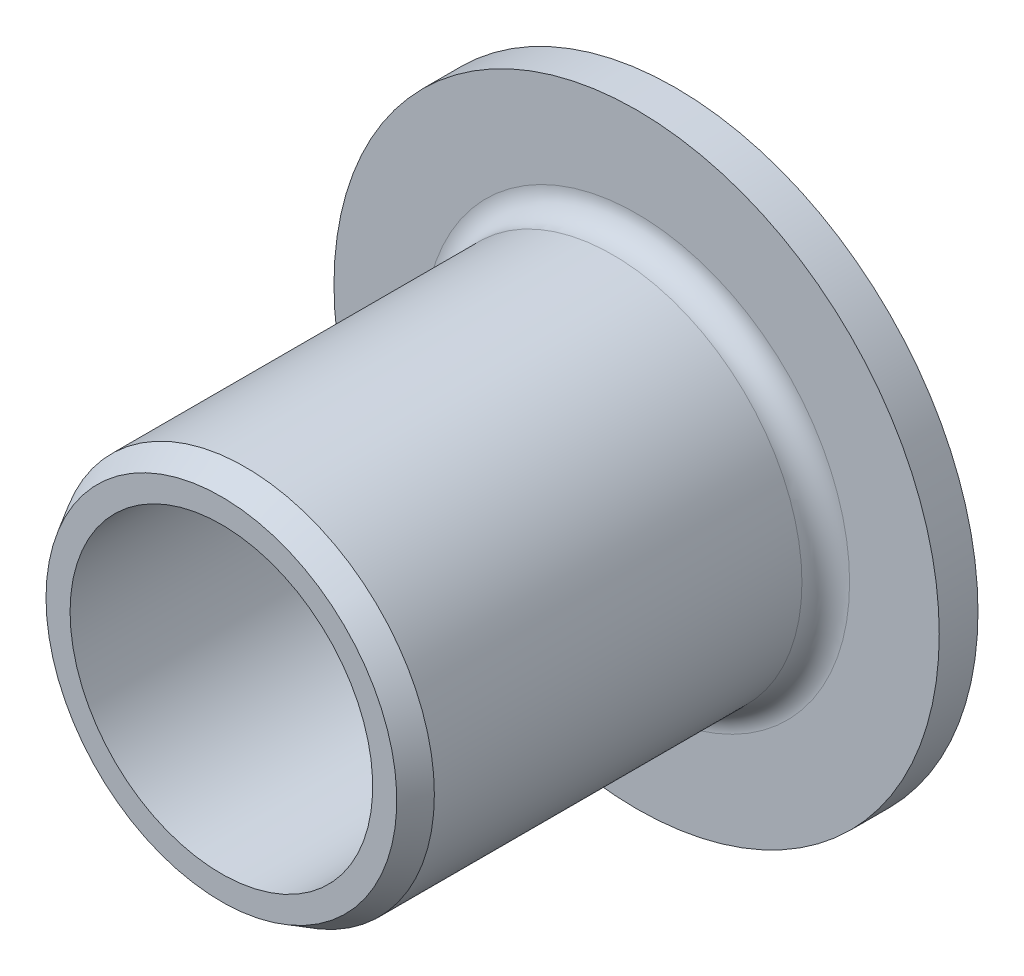
ISO-10303-21;
HEADER;
FILE_DESCRIPTION(('STEP AP214'),'2;1');
FILE_NAME('part.step','',(''),(''),'','','');
FILE_SCHEMA(('AUTOMOTIVE_DESIGN { 1 0 10303 214 1 1 1 1 }'));
ENDSEC;
DATA;
#1=APPLICATION_CONTEXT('core data for automotive mechanical design processes');
#2=APPLICATION_PROTOCOL_DEFINITION('international standard','automotive_design',2000,#1);
#3=PRODUCT_CONTEXT('',#1,'mechanical');
#4=PRODUCT('Part','Part','',(#3));
#5=PRODUCT_RELATED_PRODUCT_CATEGORY('part','',(#4));
#6=PRODUCT_DEFINITION_FORMATION('','',#4);
#7=PRODUCT_DEFINITION_CONTEXT('part definition',#1,'design');
#8=PRODUCT_DEFINITION('design','',#6,#7);
#9=PRODUCT_DEFINITION_SHAPE('','',#8);
#10=(LENGTH_UNIT() NAMED_UNIT(*) SI_UNIT(.MILLI.,.METRE.));
#11=(NAMED_UNIT(*) PLANE_ANGLE_UNIT() SI_UNIT($,.RADIAN.));
#12=(NAMED_UNIT(*) SI_UNIT($,.STERADIAN.) SOLID_ANGLE_UNIT());
#13=UNCERTAINTY_MEASURE_WITH_UNIT(LENGTH_MEASURE(1.E-05),#10,'distance_accuracy_value','');
#14=(GEOMETRIC_REPRESENTATION_CONTEXT(3) GLOBAL_UNCERTAINTY_ASSIGNED_CONTEXT((#13)) GLOBAL_UNIT_ASSIGNED_CONTEXT((#10,
#11,#12)) REPRESENTATION_CONTEXT('',''));
#15=CARTESIAN_POINT('',(0.,0.,0.));
#16=DIRECTION('',(0.,0.,1.));
#17=DIRECTION('',(1.,0.,0.));
#18=AXIS2_PLACEMENT_3D('',#15,#16,#17);
#19=CARTESIAN_POINT('',(4.7625,0.,0.));
#20=DIRECTION('',(0.,0.,-1.));
#21=DIRECTION('',(-1.,0.,0.));
#22=AXIS2_PLACEMENT_3D('',#19,#20,#21);
#23=PLANE('',#22);
#24=CARTESIAN_POINT('',(0.,0.,0.));
#25=DIRECTION('',(0.,0.,-1.));
#26=DIRECTION('',(-1.,0.,0.));
#27=AXIS2_PLACEMENT_3D('',#24,#25,#26);
#28=CIRCLE('',#27,3.175);
#29=CARTESIAN_POINT('',(-3.175,0.,0.));
#30=VERTEX_POINT('',#29);
#31=EDGE_CURVE('E123',#30,#30,#28,.F.);
#32=ORIENTED_EDGE('',*,*,#31,.T.);
#33=EDGE_LOOP('',(#32));
#34=FACE_BOUND('',#33,.T.);
#35=CARTESIAN_POINT('',(0.,0.,0.));
#36=DIRECTION('',(0.,0.,-1.));
#37=DIRECTION('',(-1.,0.,0.));
#38=AXIS2_PLACEMENT_3D('',#35,#36,#37);
#39=CIRCLE('',#38,6.35);
#40=CARTESIAN_POINT('',(-6.35,0.,0.));
#41=VERTEX_POINT('',#40);
#42=EDGE_CURVE('E127',#41,#41,#39,.F.);
#43=ORIENTED_EDGE('',*,*,#42,.F.);
#44=EDGE_LOOP('',(#43));
#45=FACE_BOUND('',#44,.T.);
#46=ADVANCED_FACE('F16',(#34,#45),#23,.T.);
#47=CARTESIAN_POINT('',(0.,0.,0.4064));
#48=DIRECTION('',(0.,0.,-1.));
#49=DIRECTION('',(-1.,0.,0.));
#50=AXIS2_PLACEMENT_3D('',#47,#48,#49);
#51=CYLINDRICAL_SURFACE('',#50,6.35);
#52=CARTESIAN_POINT('',(0.,0.,0.8128));
#53=DIRECTION('',(0.,0.,-1.));
#54=DIRECTION('',(-1.,0.,0.));
#55=AXIS2_PLACEMENT_3D('',#52,#53,#54);
#56=CIRCLE('',#55,6.35);
#57=CARTESIAN_POINT('',(-6.35,0.,0.8128));
#58=VERTEX_POINT('',#57);
#59=EDGE_CURVE('E43',#58,#58,#56,.F.);
#60=ORIENTED_EDGE('',*,*,#59,.F.);
#61=EDGE_LOOP('',(#60));
#62=FACE_BOUND('',#61,.T.);
#63=ORIENTED_EDGE('',*,*,#42,.T.);
#64=EDGE_LOOP('',(#63));
#65=FACE_BOUND('',#64,.T.);
#66=ADVANCED_FACE('F88',(#62,#65),#51,.T.);
#67=CARTESIAN_POINT('',(0.,0.,4.7625));
#68=DIRECTION('',(0.,0.,-1.));
#69=DIRECTION('',(-1.,0.,0.));
#70=AXIS2_PLACEMENT_3D('',#67,#68,#69);
#71=CYLINDRICAL_SURFACE('',#70,3.175);
#72=ORIENTED_EDGE('',*,*,#31,.F.);
#73=EDGE_LOOP('',(#72));
#74=FACE_BOUND('',#73,.T.);
#75=CARTESIAN_POINT('',(0.,0.,9.525));
#76=DIRECTION('',(0.,0.,-1.));
#77=DIRECTION('',(-1.,0.,0.));
#78=AXIS2_PLACEMENT_3D('',#75,#76,#77);
#79=CIRCLE('',#78,3.175);
#80=CARTESIAN_POINT('',(-3.175,0.,9.525));
#81=VERTEX_POINT('',#80);
#82=EDGE_CURVE('E42',#81,#81,#79,.T.);
#83=ORIENTED_EDGE('',*,*,#82,.F.);
#84=EDGE_LOOP('',(#83));
#85=FACE_BOUND('',#84,.T.);
#86=ADVANCED_FACE('F84',(#74,#85),#71,.F.);
#87=CARTESIAN_POINT('',(5.409375,0.,0.8128));
#88=DIRECTION('',(0.,0.,1.));
#89=DIRECTION('',(1.,0.,0.));
#90=AXIS2_PLACEMENT_3D('',#87,#88,#89);
#91=PLANE('',#90);
#92=ORIENTED_EDGE('',*,*,#59,.T.);
#93=EDGE_LOOP('',(#92));
#94=FACE_BOUND('',#93,.T.);
#95=CARTESIAN_POINT('',(0.,0.,0.812800000000003));
#96=DIRECTION('',(0.,0.,1.));
#97=DIRECTION('',(1.,0.,0.));
#98=AXIS2_PLACEMENT_3D('',#95,#96,#97);
#99=CIRCLE('',#98,4.46875);
#100=CARTESIAN_POINT('',(-4.46875,0.,0.812800000000002));
#101=VERTEX_POINT('',#100);
#102=CARTESIAN_POINT('',(4.46875,0.,0.812800000000002));
#103=VERTEX_POINT('',#102);
#104=EDGE_CURVE('E34',#101,#103,#99,.F.);
#105=ORIENTED_EDGE('',*,*,#104,.T.);
#106=CARTESIAN_POINT('',(0.,0.,0.812800000000003));
#107=DIRECTION('',(0.,0.,1.));
#108=DIRECTION('',(-1.,0.,0.));
#109=AXIS2_PLACEMENT_3D('',#106,#107,#108);
#110=CIRCLE('',#109,4.46875);
#111=EDGE_CURVE('E37',#103,#101,#110,.F.);
#112=ORIENTED_EDGE('',*,*,#111,.T.);
#113=EDGE_LOOP('',(#105,#112));
#114=FACE_BOUND('',#113,.T.);
#115=ADVANCED_FACE('F39',(#94,#114),#91,.T.);
#116=CARTESIAN_POINT('',(3.42753743270259,0.,9.525));
#117=DIRECTION('',(0.,0.,1.));
#118=DIRECTION('',(1.,0.,0.));
#119=AXIS2_PLACEMENT_3D('',#116,#117,#118);
#120=PLANE('',#119);
#121=CARTESIAN_POINT('',(0.,0.,9.52499999999645));
#122=DIRECTION('',(0.,0.,-1.));
#123=DIRECTION('',(-1.,0.,0.));
#124=AXIS2_PLACEMENT_3D('',#121,#122,#123);
#125=CIRCLE('',#124,3.68007486542865);
#126=CARTESIAN_POINT('',(-3.68007486542865,0.,9.52499999999645));
#127=VERTEX_POINT('',#126);
#128=EDGE_CURVE('E49',#127,#127,#125,.T.);
#129=ORIENTED_EDGE('',*,*,#128,.F.);
#130=EDGE_LOOP('',(#129));
#131=FACE_BOUND('',#130,.T.);
#132=ORIENTED_EDGE('',*,*,#82,.T.);
#133=EDGE_LOOP('',(#132));
#134=FACE_BOUND('',#133,.T.);
#135=ADVANCED_FACE('F68',(#131,#134),#120,.T.);
#136=CARTESIAN_POINT('',(0.,0.,1.3128));
#137=DIRECTION('',(0.,0.,1.));
#138=DIRECTION('',(1.,0.,0.));
#139=AXIS2_PLACEMENT_3D('',#136,#137,#138);
#140=TOROIDAL_SURFACE('',#139,4.46875,0.499999999999997);
#141=CARTESIAN_POINT('',(0.,0.,1.3128));
#142=DIRECTION('',(0.,0.,-1.));
#143=DIRECTION('',(-1.,0.,0.));
#144=AXIS2_PLACEMENT_3D('',#141,#142,#143);
#145=CIRCLE('',#144,3.96875);
#146=CARTESIAN_POINT('',(-3.96875,0.,1.3128));
#147=VERTEX_POINT('',#146);
#148=EDGE_CURVE('E27',#147,#147,#145,.F.);
#149=ORIENTED_EDGE('',*,*,#148,.F.);
#150=EDGE_LOOP('',(#149));
#151=FACE_BOUND('',#150,.T.);
#152=ORIENTED_EDGE('',*,*,#111,.F.);
#153=ORIENTED_EDGE('',*,*,#104,.F.);
#154=EDGE_LOOP('',(#152,#153));
#155=FACE_BOUND('',#154,.T.);
#156=ADVANCED_FACE('F47',(#151,#155),#140,.F.);
#157=CARTESIAN_POINT('',(0.,0.,9.02500000000828));
#158=DIRECTION('',(0.,0.,-1.));
#159=DIRECTION('',(-1.,0.,0.));
#160=AXIS2_PLACEMENT_3D('',#157,#158,#159);
#161=CONICAL_SURFACE('',#160,3.96875000001273,0.523598775592442);
#162=ORIENTED_EDGE('',*,*,#128,.T.);
#163=EDGE_LOOP('',(#162));
#164=FACE_BOUND('',#163,.T.);
#165=CARTESIAN_POINT('',(0.,0.,9.025));
#166=DIRECTION('',(0.,0.,-1.));
#167=DIRECTION('',(-1.,0.,0.));
#168=AXIS2_PLACEMENT_3D('',#165,#166,#167);
#169=CIRCLE('',#168,3.96875);
#170=CARTESIAN_POINT('',(-3.96875,0.,9.025));
#171=VERTEX_POINT('',#170);
#172=EDGE_CURVE('E11',#171,#171,#169,.T.);
#173=ORIENTED_EDGE('',*,*,#172,.F.);
#174=EDGE_LOOP('',(#173));
#175=FACE_BOUND('',#174,.T.);
#176=ADVANCED_FACE('F67',(#164,#175),#161,.T.);
#177=CARTESIAN_POINT('',(0.,0.,5.1689));
#178=DIRECTION('',(0.,0.,-1.));
#179=DIRECTION('',(-1.,0.,0.));
#180=AXIS2_PLACEMENT_3D('',#177,#178,#179);
#181=CYLINDRICAL_SURFACE('',#180,3.96875);
#182=ORIENTED_EDGE('',*,*,#148,.T.);
#183=EDGE_LOOP('',(#182));
#184=FACE_BOUND('',#183,.T.);
#185=ORIENTED_EDGE('',*,*,#172,.T.);
#186=EDGE_LOOP('',(#185));
#187=FACE_BOUND('',#186,.T.);
#188=ADVANCED_FACE('F99',(#184,#187),#181,.T.);
#189=CLOSED_SHELL('',(#46,#66,#86,#115,#135,#156,#176,#188));
#190=MANIFOLD_SOLID_BREP('B1',#189);
#191=ADVANCED_BREP_SHAPE_REPRESENTATION('',(#18,#190),#14);
#192=SHAPE_DEFINITION_REPRESENTATION(#9,#191);
ENDSEC;
END-ISO-10303-21;
